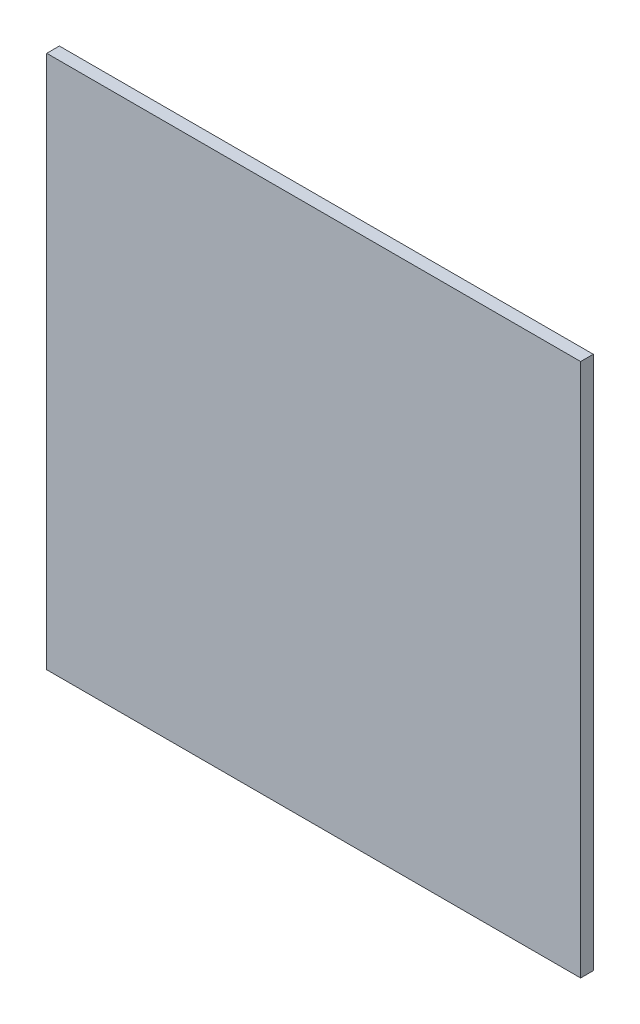
ISO-10303-21;
HEADER;
FILE_DESCRIPTION(('STEP AP214'),'2;1');
FILE_NAME('part.step','',(''),(''),'','','');
FILE_SCHEMA(('AUTOMOTIVE_DESIGN { 1 0 10303 214 1 1 1 1 }'));
ENDSEC;
DATA;
#1=APPLICATION_CONTEXT('core data for automotive mechanical design processes');
#2=APPLICATION_PROTOCOL_DEFINITION('international standard','automotive_design',2000,#1);
#3=PRODUCT_CONTEXT('',#1,'mechanical');
#4=PRODUCT('Part','Part','',(#3));
#5=PRODUCT_RELATED_PRODUCT_CATEGORY('part','',(#4));
#6=PRODUCT_DEFINITION_FORMATION('','',#4);
#7=PRODUCT_DEFINITION_CONTEXT('part definition',#1,'design');
#8=PRODUCT_DEFINITION('design','',#6,#7);
#9=PRODUCT_DEFINITION_SHAPE('','',#8);
#10=(LENGTH_UNIT() NAMED_UNIT(*) SI_UNIT(.MILLI.,.METRE.));
#11=(NAMED_UNIT(*) PLANE_ANGLE_UNIT() SI_UNIT($,.RADIAN.));
#12=(NAMED_UNIT(*) SI_UNIT($,.STERADIAN.) SOLID_ANGLE_UNIT());
#13=UNCERTAINTY_MEASURE_WITH_UNIT(LENGTH_MEASURE(1.E-05),#10,'distance_accuracy_value','');
#14=(GEOMETRIC_REPRESENTATION_CONTEXT(3) GLOBAL_UNCERTAINTY_ASSIGNED_CONTEXT((#13)) GLOBAL_UNIT_ASSIGNED_CONTEXT((#10,
#11,#12)) REPRESENTATION_CONTEXT('',''));
#15=CARTESIAN_POINT('',(0.,0.,0.));
#16=DIRECTION('',(0.,0.,1.));
#17=DIRECTION('',(1.,0.,0.));
#18=AXIS2_PLACEMENT_3D('',#15,#16,#17);
#19=CARTESIAN_POINT('',(6.60008,5.6,0.));
#20=DIRECTION('',(0.,0.,-1.));
#21=DIRECTION('',(-1.,0.,0.));
#22=AXIS2_PLACEMENT_3D('',#19,#20,#21);
#23=PLANE('',#22);
#24=DIRECTION('',(1.,0.,0.));
#25=VECTOR('',#24,1.);
#26=CARTESIAN_POINT('',(5.87508,6.325,0.));
#27=LINE('',#26,#25);
#28=CARTESIAN_POINT('',(5.87508,6.325,0.));
#29=VERTEX_POINT('',#28);
#30=CARTESIAN_POINT('',(7.32508,6.325,0.));
#31=VERTEX_POINT('',#30);
#32=EDGE_CURVE('E55',#29,#31,#27,.T.);
#33=ORIENTED_EDGE('',*,*,#32,.T.);
#34=DIRECTION('',(0.,1.,0.));
#35=VECTOR('',#34,1.);
#36=CARTESIAN_POINT('',(7.32508,6.325,0.));
#37=LINE('',#36,#35);
#38=CARTESIAN_POINT('',(7.32508,4.875,0.));
#39=VERTEX_POINT('',#38);
#40=EDGE_CURVE('E57',#31,#39,#37,.F.);
#41=ORIENTED_EDGE('',*,*,#40,.T.);
#42=DIRECTION('',(1.,0.,0.));
#43=VECTOR('',#42,1.);
#44=CARTESIAN_POINT('',(7.32508,4.875,0.));
#45=LINE('',#44,#43);
#46=CARTESIAN_POINT('',(5.87508,4.875,0.));
#47=VERTEX_POINT('',#46);
#48=EDGE_CURVE('E20',#39,#47,#45,.F.);
#49=ORIENTED_EDGE('',*,*,#48,.T.);
#50=DIRECTION('',(0.,1.,0.));
#51=VECTOR('',#50,1.);
#52=CARTESIAN_POINT('',(5.87508,4.875,0.));
#53=LINE('',#52,#51);
#54=EDGE_CURVE('E80',#47,#29,#53,.T.);
#55=ORIENTED_EDGE('',*,*,#54,.T.);
#56=EDGE_LOOP('',(#33,#41,#49,#55));
#57=FACE_BOUND('',#56,.T.);
#58=ADVANCED_FACE('F17',(#57),#23,.T.);
#59=CARTESIAN_POINT('',(7.32508,4.875,0.));
#60=DIRECTION('',(0.,1.,0.));
#61=DIRECTION('',(0.,0.,1.));
#62=AXIS2_PLACEMENT_3D('',#59,#60,#61);
#63=PLANE('',#62);
#64=DIRECTION('',(0.,0.,-1.));
#65=VECTOR('',#64,1.);
#66=CARTESIAN_POINT('',(5.87508,4.875,0.));
#67=LINE('',#66,#65);
#68=CARTESIAN_POINT('',(5.87508,4.875,0.03429));
#69=VERTEX_POINT('',#68);
#70=EDGE_CURVE('E68',#69,#47,#67,.T.);
#71=ORIENTED_EDGE('',*,*,#70,.T.);
#72=ORIENTED_EDGE('',*,*,#48,.F.);
#73=DIRECTION('',(0.,0.,1.));
#74=VECTOR('',#73,1.);
#75=CARTESIAN_POINT('',(7.32508,4.875,0.));
#76=LINE('',#75,#74);
#77=CARTESIAN_POINT('',(7.32508,4.875,0.03429));
#78=VERTEX_POINT('',#77);
#79=EDGE_CURVE('E63',#39,#78,#76,.T.);
#80=ORIENTED_EDGE('',*,*,#79,.T.);
#81=DIRECTION('',(1.,0.,0.));
#82=VECTOR('',#81,1.);
#83=CARTESIAN_POINT('',(6.60008,4.875,0.03429));
#84=LINE('',#83,#82);
#85=EDGE_CURVE('E83',#69,#78,#84,.T.);
#86=ORIENTED_EDGE('',*,*,#85,.F.);
#87=EDGE_LOOP('',(#71,#72,#80,#86));
#88=FACE_BOUND('',#87,.T.);
#89=ADVANCED_FACE('F65',(#88),#63,.F.);
#90=CARTESIAN_POINT('',(7.32508,6.325,0.));
#91=DIRECTION('',(-1.,0.,0.));
#92=DIRECTION('',(0.,0.,1.));
#93=AXIS2_PLACEMENT_3D('',#90,#91,#92);
#94=PLANE('',#93);
#95=ORIENTED_EDGE('',*,*,#79,.F.);
#96=ORIENTED_EDGE('',*,*,#40,.F.);
#97=DIRECTION('',(0.,0.,-1.));
#98=VECTOR('',#97,1.);
#99=CARTESIAN_POINT('',(7.32508,6.325,0.));
#100=LINE('',#99,#98);
#101=CARTESIAN_POINT('',(7.32508,6.325,0.03429));
#102=VERTEX_POINT('',#101);
#103=EDGE_CURVE('E75',#31,#102,#100,.F.);
#104=ORIENTED_EDGE('',*,*,#103,.T.);
#105=DIRECTION('',(0.,1.,0.));
#106=VECTOR('',#105,1.);
#107=CARTESIAN_POINT('',(7.32508,5.6,0.03429));
#108=LINE('',#107,#106);
#109=EDGE_CURVE('E72',#78,#102,#108,.T.);
#110=ORIENTED_EDGE('',*,*,#109,.F.);
#111=EDGE_LOOP('',(#95,#96,#104,#110));
#112=FACE_BOUND('',#111,.T.);
#113=ADVANCED_FACE('F70',(#112),#94,.F.);
#114=CARTESIAN_POINT('',(5.87508,6.325,0.));
#115=DIRECTION('',(0.,-1.,0.));
#116=DIRECTION('',(0.,0.,-1.));
#117=AXIS2_PLACEMENT_3D('',#114,#115,#116);
#118=PLANE('',#117);
#119=ORIENTED_EDGE('',*,*,#103,.F.);
#120=ORIENTED_EDGE('',*,*,#32,.F.);
#121=DIRECTION('',(0.,0.,-1.));
#122=VECTOR('',#121,1.);
#123=CARTESIAN_POINT('',(5.87508,6.325,0.));
#124=LINE('',#123,#122);
#125=CARTESIAN_POINT('',(5.87508,6.325,0.03429));
#126=VERTEX_POINT('',#125);
#127=EDGE_CURVE('E35',#29,#126,#124,.F.);
#128=ORIENTED_EDGE('',*,*,#127,.T.);
#129=DIRECTION('',(1.,0.,0.));
#130=VECTOR('',#129,1.);
#131=CARTESIAN_POINT('',(6.60008,6.325,0.03429));
#132=LINE('',#131,#130);
#133=EDGE_CURVE('E26',#102,#126,#132,.F.);
#134=ORIENTED_EDGE('',*,*,#133,.F.);
#135=EDGE_LOOP('',(#119,#120,#128,#134));
#136=FACE_BOUND('',#135,.T.);
#137=ADVANCED_FACE('F89',(#136),#118,.F.);
#138=CARTESIAN_POINT('',(5.87508,4.875,0.));
#139=DIRECTION('',(1.,0.,0.));
#140=DIRECTION('',(0.,0.,-1.));
#141=AXIS2_PLACEMENT_3D('',#138,#139,#140);
#142=PLANE('',#141);
#143=ORIENTED_EDGE('',*,*,#127,.F.);
#144=ORIENTED_EDGE('',*,*,#54,.F.);
#145=ORIENTED_EDGE('',*,*,#70,.F.);
#146=DIRECTION('',(0.,1.,0.));
#147=VECTOR('',#146,1.);
#148=CARTESIAN_POINT('',(5.87508,5.6,0.03429));
#149=LINE('',#148,#147);
#150=EDGE_CURVE('E11',#126,#69,#149,.F.);
#151=ORIENTED_EDGE('',*,*,#150,.F.);
#152=EDGE_LOOP('',(#143,#144,#145,#151));
#153=FACE_BOUND('',#152,.T.);
#154=ADVANCED_FACE('F91',(#153),#142,.F.);
#155=CARTESIAN_POINT('',(6.60008,5.6,0.03429));
#156=DIRECTION('',(0.,0.,1.));
#157=DIRECTION('',(1.,0.,0.));
#158=AXIS2_PLACEMENT_3D('',#155,#156,#157);
#159=PLANE('',#158);
#160=ORIENTED_EDGE('',*,*,#133,.T.);
#161=ORIENTED_EDGE('',*,*,#150,.T.);
#162=ORIENTED_EDGE('',*,*,#85,.T.);
#163=ORIENTED_EDGE('',*,*,#109,.T.);
#164=EDGE_LOOP('',(#160,#161,#162,#163));
#165=FACE_BOUND('',#164,.T.);
#166=ADVANCED_FACE('F88',(#165),#159,.T.);
#167=CLOSED_SHELL('',(#58,#89,#113,#137,#154,#166));
#168=MANIFOLD_SOLID_BREP('B1',#167);
#169=ADVANCED_BREP_SHAPE_REPRESENTATION('',(#18,#168),#14);
#170=SHAPE_DEFINITION_REPRESENTATION(#9,#169);
ENDSEC;
END-ISO-10303-21;
